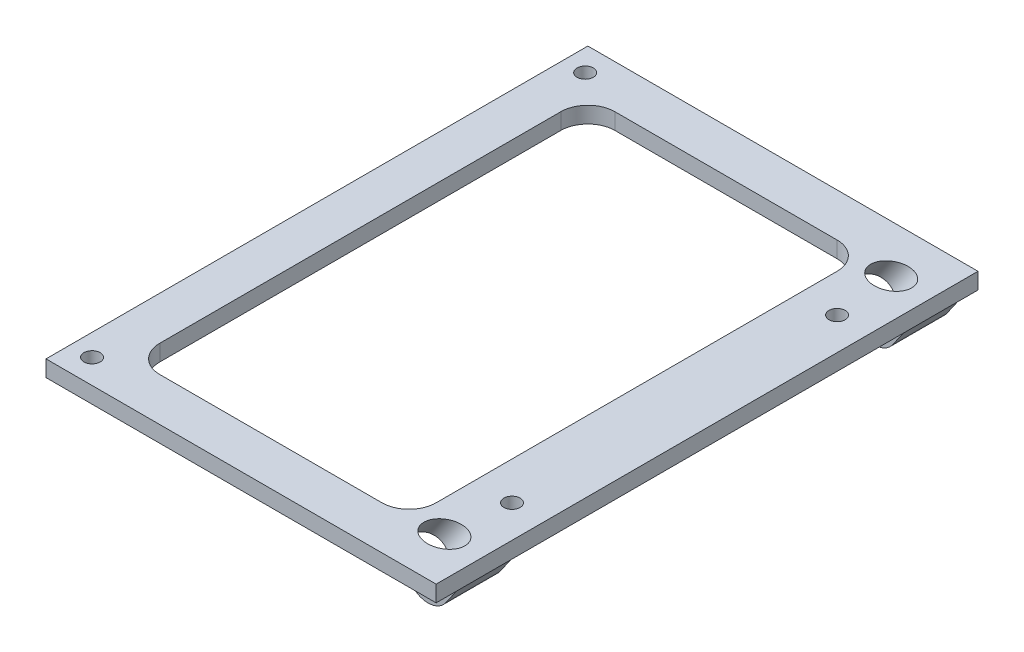
ISO-10303-21;
HEADER;
FILE_DESCRIPTION(('STEP AP214'),'2;1');
FILE_NAME('part.step','',(''),(''),'','','');
FILE_SCHEMA(('AUTOMOTIVE_DESIGN { 1 0 10303 214 1 1 1 1 }'));
ENDSEC;
DATA;
#1=APPLICATION_CONTEXT('core data for automotive mechanical design processes');
#2=APPLICATION_PROTOCOL_DEFINITION('international standard','automotive_design',2000,#1);
#3=PRODUCT_CONTEXT('',#1,'mechanical');
#4=PRODUCT('Part','Part','',(#3));
#5=PRODUCT_RELATED_PRODUCT_CATEGORY('part','',(#4));
#6=PRODUCT_DEFINITION_FORMATION('','',#4);
#7=PRODUCT_DEFINITION_CONTEXT('part definition',#1,'design');
#8=PRODUCT_DEFINITION('design','',#6,#7);
#9=PRODUCT_DEFINITION_SHAPE('','',#8);
#10=(LENGTH_UNIT() NAMED_UNIT(*) SI_UNIT(.MILLI.,.METRE.));
#11=(NAMED_UNIT(*) PLANE_ANGLE_UNIT() SI_UNIT($,.RADIAN.));
#12=(NAMED_UNIT(*) SI_UNIT($,.STERADIAN.) SOLID_ANGLE_UNIT());
#13=UNCERTAINTY_MEASURE_WITH_UNIT(LENGTH_MEASURE(1.E-05),#10,'distance_accuracy_value','');
#14=(GEOMETRIC_REPRESENTATION_CONTEXT(3) GLOBAL_UNCERTAINTY_ASSIGNED_CONTEXT((#13)) GLOBAL_UNIT_ASSIGNED_CONTEXT((#10,
#11,#12)) REPRESENTATION_CONTEXT('',''));
#15=CARTESIAN_POINT('',(0.,0.,0.));
#16=DIRECTION('',(0.,0.,1.));
#17=DIRECTION('',(1.,0.,0.));
#18=AXIS2_PLACEMENT_3D('',#15,#16,#17);
#19=CARTESIAN_POINT('',(62.,-3.,0.));
#20=DIRECTION('',(1.,0.,0.));
#21=DIRECTION('',(0.,0.,-1.));
#22=AXIS2_PLACEMENT_3D('',#19,#20,#21);
#23=PLANE('',#22);
#24=DIRECTION('',(0.,0.,1.));
#25=VECTOR('',#24,1.);
#26=CARTESIAN_POINT('',(62.,-3.,31.2272925792628));
#27=LINE('',#26,#25);
#28=CARTESIAN_POINT('',(62.,-3.,36.2272925792628));
#29=VERTEX_POINT('',#28);
#30=CARTESIAN_POINT('',(62.,-3.,37.));
#31=VERTEX_POINT('',#30);
#32=EDGE_CURVE('E367',#29,#31,#27,.T.);
#33=ORIENTED_EDGE('',*,*,#32,.T.);
#34=DIRECTION('',(0.,1.,0.));
#35=VECTOR('',#34,1.);
#36=CARTESIAN_POINT('',(62.,-3.,37.));
#37=LINE('',#36,#35);
#38=CARTESIAN_POINT('',(62.,0.,37.));
#39=VERTEX_POINT('',#38);
#40=EDGE_CURVE('E249',#31,#39,#37,.T.);
#41=ORIENTED_EDGE('',*,*,#40,.T.);
#42=DIRECTION('',(0.,0.,-1.));
#43=VECTOR('',#42,1.);
#44=CARTESIAN_POINT('',(62.,0.,0.));
#45=LINE('',#44,#43);
#46=CARTESIAN_POINT('',(62.,0.,-37.));
#47=VERTEX_POINT('',#46);
#48=EDGE_CURVE('E270',#39,#47,#45,.T.);
#49=ORIENTED_EDGE('',*,*,#48,.T.);
#50=DIRECTION('',(0.,1.,0.));
#51=VECTOR('',#50,1.);
#52=CARTESIAN_POINT('',(62.,-3.,-37.));
#53=LINE('',#52,#51);
#54=CARTESIAN_POINT('',(62.,-3.,-37.));
#55=VERTEX_POINT('',#54);
#56=EDGE_CURVE('E252',#55,#47,#53,.T.);
#57=ORIENTED_EDGE('',*,*,#56,.F.);
#58=DIRECTION('',(0.,0.,-1.));
#59=VECTOR('',#58,1.);
#60=CARTESIAN_POINT('',(62.,-3.,-31.2272925792628));
#61=LINE('',#60,#59);
#62=CARTESIAN_POINT('',(62.,-3.,-36.2272925792628));
#63=VERTEX_POINT('',#62);
#64=EDGE_CURVE('E339',#63,#55,#61,.T.);
#65=ORIENTED_EDGE('',*,*,#64,.F.);
#66=DIRECTION('',(0.,0.,-1.));
#67=VECTOR('',#66,1.);
#68=CARTESIAN_POINT('',(62.,-3.,0.));
#69=LINE('',#68,#67);
#70=EDGE_CURVE('E305',#29,#63,#69,.T.);
#71=ORIENTED_EDGE('',*,*,#70,.F.);
#72=EDGE_LOOP('',(#33,#41,#49,#57,#65,#71));
#73=FACE_BOUND('',#72,.T.);
#74=ADVANCED_FACE('F34',(#73),#23,.F.);
#75=CARTESIAN_POINT('',(62.,-14.,36.2272925792628));
#76=DIRECTION('',(0.,0.,-1.));
#77=DIRECTION('',(-1.,0.,0.));
#78=AXIS2_PLACEMENT_3D('',#75,#76,#77);
#79=PLANE('',#78);
#80=DIRECTION('',(0.573576436351039,0.819152044288997,0.));
#81=VECTOR('',#80,1.);
#82=CARTESIAN_POINT('',(65.5548215172945,-16.4891128233996,36.2272925792628));
#83=LINE('',#82,#81);
#84=CARTESIAN_POINT('',(73.0174366770211,-5.83139385795238,36.2272925792628));
#85=VERTEX_POINT('',#84);
#86=CARTESIAN_POINT('',(75.,-3.,36.2272925792628));
#87=VERTEX_POINT('',#86);
#88=EDGE_CURVE('E364',#85,#87,#83,.T.);
#89=ORIENTED_EDGE('',*,*,#88,.F.);
#90=CARTESIAN_POINT('',(69.7408284998651,-3.53708811254823,36.2272925792628));
#91=DIRECTION('',(0.,0.,-1.));
#92=DIRECTION('',(-1.,0.,0.));
#93=AXIS2_PLACEMENT_3D('',#90,#91,#92);
#94=CIRCLE('',#93,4.);
#95=CARTESIAN_POINT('',(67.446522754461,-6.81369628970421,36.2272925792628));
#96=VERTEX_POINT('',#95);
#97=EDGE_CURVE('E11',#85,#96,#94,.T.);
#98=ORIENTED_EDGE('',*,*,#97,.T.);
#99=DIRECTION('',(-0.819152044288996,0.573576436351039,0.));
#100=VECTOR('',#99,1.);
#101=CARTESIAN_POINT('',(67.1683094143225,-6.61888921170874,36.2272925792628));
#102=LINE('',#101,#100);
#103=EDGE_CURVE('E362',#96,#29,#102,.T.);
#104=ORIENTED_EDGE('',*,*,#103,.T.);
#105=DIRECTION('',(-1.,0.,0.));
#106=VECTOR('',#105,1.);
#107=CARTESIAN_POINT('',(62.,-3.,36.2272925792628));
#108=LINE('',#107,#106);
#109=EDGE_CURVE('E359',#87,#29,#108,.T.);
#110=ORIENTED_EDGE('',*,*,#109,.F.);
#111=EDGE_LOOP('',(#89,#98,#104,#110));
#112=FACE_BOUND('',#111,.T.);
#113=ADVANCED_FACE('F488',(#112),#79,.T.);
#114=CARTESIAN_POINT('',(62.,-14.,46.2272925792628));
#115=DIRECTION('',(0.,0.,1.));
#116=DIRECTION('',(1.,0.,0.));
#117=AXIS2_PLACEMENT_3D('',#114,#115,#116);
#118=PLANE('',#117);
#119=DIRECTION('',(0.819152044288996,-0.573576436351039,0.));
#120=VECTOR('',#119,1.);
#121=CARTESIAN_POINT('',(18.9878366257249,27.1174410293745,46.2272925792628));
#122=LINE('',#121,#120);
#123=CARTESIAN_POINT('',(62.,-3.,46.2272925792628));
#124=VERTEX_POINT('',#123);
#125=CARTESIAN_POINT('',(67.446522754461,-6.81369628970421,46.2272925792628));
#126=VERTEX_POINT('',#125);
#127=EDGE_CURVE('E212',#124,#126,#122,.T.);
#128=ORIENTED_EDGE('',*,*,#127,.T.);
#129=CARTESIAN_POINT('',(69.7408284998651,-3.53708811254823,46.2272925792628));
#130=DIRECTION('',(0.,0.,1.));
#131=DIRECTION('',(1.,0.,0.));
#132=AXIS2_PLACEMENT_3D('',#129,#130,#131);
#133=CIRCLE('',#132,4.);
#134=CARTESIAN_POINT('',(73.0174366770211,-5.83139385795238,46.2272925792628));
#135=VERTEX_POINT('',#134);
#136=EDGE_CURVE('E56',#126,#135,#133,.T.);
#137=ORIENTED_EDGE('',*,*,#136,.T.);
#138=DIRECTION('',(-0.573576436351039,-0.819152044288997,0.));
#139=VECTOR('',#138,1.);
#140=CARTESIAN_POINT('',(51.735294305892,-36.2254430644828,46.2272925792628));
#141=LINE('',#140,#139);
#142=CARTESIAN_POINT('',(75.,-3.,46.2272925792628));
#143=VERTEX_POINT('',#142);
#144=EDGE_CURVE('E369',#143,#135,#141,.T.);
#145=ORIENTED_EDGE('',*,*,#144,.F.);
#146=DIRECTION('',(1.,0.,0.));
#147=VECTOR('',#146,1.);
#148=CARTESIAN_POINT('',(62.,-3.,46.2272925792628));
#149=LINE('',#148,#147);
#150=EDGE_CURVE('E357',#124,#143,#149,.T.);
#151=ORIENTED_EDGE('',*,*,#150,.F.);
#152=EDGE_LOOP('',(#128,#137,#145,#151));
#153=FACE_BOUND('',#152,.T.);
#154=ADVANCED_FACE('F505',(#153),#118,.T.);
#155=CARTESIAN_POINT('',(0.,-3.,0.));
#156=DIRECTION('',(0.,-1.,0.));
#157=DIRECTION('',(0.,0.,-1.));
#158=AXIS2_PLACEMENT_3D('',#155,#156,#157);
#159=PLANE('',#158);
#160=CARTESIAN_POINT('',(69.,-3.,-30.));
#161=DIRECTION('',(0.,-1.,0.));
#162=DIRECTION('',(0.,0.,-1.));
#163=AXIS2_PLACEMENT_3D('',#160,#161,#162);
#164=CIRCLE('',#163,1.5);
#165=CARTESIAN_POINT('',(69.,-3.,-31.5));
#166=VERTEX_POINT('',#165);
#167=EDGE_CURVE('E198',#166,#166,#164,.T.);
#168=ORIENTED_EDGE('',*,*,#167,.F.);
#169=EDGE_LOOP('',(#168));
#170=FACE_BOUND('',#169,.T.);
#171=CARTESIAN_POINT('',(69.,-3.,30.));
#172=DIRECTION('',(0.,-1.,0.));
#173=DIRECTION('',(0.,0.,-1.));
#174=AXIS2_PLACEMENT_3D('',#171,#172,#173);
#175=CIRCLE('',#174,1.5);
#176=CARTESIAN_POINT('',(69.,-3.,28.5));
#177=VERTEX_POINT('',#176);
#178=EDGE_CURVE('E377',#177,#177,#175,.T.);
#179=ORIENTED_EDGE('',*,*,#178,.F.);
#180=EDGE_LOOP('',(#179));
#181=FACE_BOUND('',#180,.T.);
#182=ORIENTED_EDGE('',*,*,#109,.T.);
#183=ORIENTED_EDGE('',*,*,#70,.T.);
#184=DIRECTION('',(-1.,0.,0.));
#185=VECTOR('',#184,1.);
#186=CARTESIAN_POINT('',(62.,-3.,-36.2272925792628));
#187=LINE('',#186,#185);
#188=CARTESIAN_POINT('',(75.,-3.,-36.2272925792628));
#189=VERTEX_POINT('',#188);
#190=EDGE_CURVE('E299',#189,#63,#187,.T.);
#191=ORIENTED_EDGE('',*,*,#190,.F.);
#192=DIRECTION('',(0.,0.,-1.));
#193=VECTOR('',#192,1.);
#194=CARTESIAN_POINT('',(75.,-3.,0.));
#195=LINE('',#194,#193);
#196=EDGE_CURVE('E327',#87,#189,#195,.T.);
#197=ORIENTED_EDGE('',*,*,#196,.F.);
#198=EDGE_LOOP('',(#182,#183,#191,#197));
#199=FACE_BOUND('',#198,.T.);
#200=ADVANCED_FACE('F486',(#170,#181,#199),#159,.T.);
#201=CARTESIAN_POINT('',(75.,-3.,0.));
#202=DIRECTION('',(1.,0.,0.));
#203=DIRECTION('',(0.,0.,-1.));
#204=AXIS2_PLACEMENT_3D('',#201,#202,#203);
#205=PLANE('',#204);
#206=DIRECTION('',(0.,0.,1.));
#207=VECTOR('',#206,1.);
#208=CARTESIAN_POINT('',(75.,-3.,31.2272925792628));
#209=LINE('',#208,#207);
#210=EDGE_CURVE('E366',#87,#143,#209,.T.);
#211=ORIENTED_EDGE('',*,*,#210,.F.);
#212=ORIENTED_EDGE('',*,*,#196,.T.);
#213=DIRECTION('',(0.,0.,-1.));
#214=VECTOR('',#213,1.);
#215=CARTESIAN_POINT('',(75.,-3.,-31.2272925792628));
#216=LINE('',#215,#214);
#217=CARTESIAN_POINT('',(75.,-3.,-46.2272925792628));
#218=VERTEX_POINT('',#217);
#219=EDGE_CURVE('E342',#189,#218,#216,.T.);
#220=ORIENTED_EDGE('',*,*,#219,.T.);
#221=CARTESIAN_POINT('',(75.,-3.,-50.));
#222=VERTEX_POINT('',#221);
#223=EDGE_CURVE('E328',#218,#222,#195,.T.);
#224=ORIENTED_EDGE('',*,*,#223,.T.);
#225=DIRECTION('',(0.,1.,0.));
#226=VECTOR('',#225,1.);
#227=CARTESIAN_POINT('',(75.,-3.,-50.));
#228=LINE('',#227,#226);
#229=CARTESIAN_POINT('',(75.,0.,-50.));
#230=VERTEX_POINT('',#229);
#231=EDGE_CURVE('E232',#222,#230,#228,.T.);
#232=ORIENTED_EDGE('',*,*,#231,.T.);
#233=DIRECTION('',(0.,0.,-1.));
#234=VECTOR('',#233,1.);
#235=CARTESIAN_POINT('',(75.,0.,0.));
#236=LINE('',#235,#234);
#237=CARTESIAN_POINT('',(75.,0.,50.));
#238=VERTEX_POINT('',#237);
#239=EDGE_CURVE('E290',#238,#230,#236,.T.);
#240=ORIENTED_EDGE('',*,*,#239,.F.);
#241=DIRECTION('',(0.,1.,0.));
#242=VECTOR('',#241,1.);
#243=CARTESIAN_POINT('',(75.,-3.,50.));
#244=LINE('',#243,#242);
#245=CARTESIAN_POINT('',(75.,-3.,50.));
#246=VERTEX_POINT('',#245);
#247=EDGE_CURVE('E234',#246,#238,#244,.T.);
#248=ORIENTED_EDGE('',*,*,#247,.F.);
#249=EDGE_CURVE('E324',#246,#143,#195,.T.);
#250=ORIENTED_EDGE('',*,*,#249,.T.);
#251=EDGE_LOOP('',(#211,#212,#220,#224,#232,#240,#248,#250));
#252=FACE_BOUND('',#251,.T.);
#253=ADVANCED_FACE('F483',(#252),#205,.T.);
#254=CARTESIAN_POINT('',(11.,-3.,0.));
#255=DIRECTION('',(-1.,0.,0.));
#256=DIRECTION('',(0.,0.,1.));
#257=AXIS2_PLACEMENT_3D('',#254,#255,#256);
#258=PLANE('',#257);
#259=DIRECTION('',(0.,0.,1.));
#260=VECTOR('',#259,1.);
#261=CARTESIAN_POINT('',(11.,0.,0.));
#262=LINE('',#261,#260);
#263=CARTESIAN_POINT('',(11.,0.,-37.));
#264=VERTEX_POINT('',#263);
#265=CARTESIAN_POINT('',(11.,0.,37.));
#266=VERTEX_POINT('',#265);
#267=EDGE_CURVE('E278',#264,#266,#262,.T.);
#268=ORIENTED_EDGE('',*,*,#267,.T.);
#269=DIRECTION('',(0.,1.,0.));
#270=VECTOR('',#269,1.);
#271=CARTESIAN_POINT('',(11.,-3.,37.));
#272=LINE('',#271,#270);
#273=CARTESIAN_POINT('',(11.,-3.,37.));
#274=VERTEX_POINT('',#273);
#275=EDGE_CURVE('E239',#274,#266,#272,.T.);
#276=ORIENTED_EDGE('',*,*,#275,.F.);
#277=DIRECTION('',(0.,0.,1.));
#278=VECTOR('',#277,1.);
#279=CARTESIAN_POINT('',(11.,-3.,0.));
#280=LINE('',#279,#278);
#281=CARTESIAN_POINT('',(11.,-3.,-37.));
#282=VERTEX_POINT('',#281);
#283=EDGE_CURVE('E313',#282,#274,#280,.T.);
#284=ORIENTED_EDGE('',*,*,#283,.F.);
#285=DIRECTION('',(0.,1.,0.));
#286=VECTOR('',#285,1.);
#287=CARTESIAN_POINT('',(11.,-3.,-37.));
#288=LINE('',#287,#286);
#289=EDGE_CURVE('E231',#282,#264,#288,.T.);
#290=ORIENTED_EDGE('',*,*,#289,.T.);
#291=EDGE_LOOP('',(#268,#276,#284,#290));
#292=FACE_BOUND('',#291,.T.);
#293=ADVANCED_FACE('F413',(#292),#258,.F.);
#294=CARTESIAN_POINT('',(16.,-3.,37.));
#295=DIRECTION('',(0.,1.,0.));
#296=DIRECTION('',(0.,0.,1.));
#297=AXIS2_PLACEMENT_3D('',#294,#295,#296);
#298=CYLINDRICAL_SURFACE('',#297,5.00000000000001);
#299=CARTESIAN_POINT('',(16.,0.,37.));
#300=DIRECTION('',(0.,-1.,0.));
#301=DIRECTION('',(0.,0.,-1.));
#302=AXIS2_PLACEMENT_3D('',#299,#300,#301);
#303=CIRCLE('',#302,5.00000000000001);
#304=CARTESIAN_POINT('',(16.,0.,42.));
#305=VERTEX_POINT('',#304);
#306=EDGE_CURVE('E276',#266,#305,#303,.F.);
#307=ORIENTED_EDGE('',*,*,#306,.T.);
#308=DIRECTION('',(0.,1.,0.));
#309=VECTOR('',#308,1.);
#310=CARTESIAN_POINT('',(16.,-3.,42.));
#311=LINE('',#310,#309);
#312=CARTESIAN_POINT('',(16.,-3.,42.));
#313=VERTEX_POINT('',#312);
#314=EDGE_CURVE('E243',#313,#305,#311,.T.);
#315=ORIENTED_EDGE('',*,*,#314,.F.);
#316=CARTESIAN_POINT('',(16.,-3.,37.));
#317=DIRECTION('',(0.,-1.,0.));
#318=DIRECTION('',(0.,0.,-1.));
#319=AXIS2_PLACEMENT_3D('',#316,#317,#318);
#320=CIRCLE('',#319,5.00000000000001);
#321=EDGE_CURVE('E311',#274,#313,#320,.F.);
#322=ORIENTED_EDGE('',*,*,#321,.F.);
#323=ORIENTED_EDGE('',*,*,#275,.T.);
#324=EDGE_LOOP('',(#307,#315,#322,#323));
#325=FACE_BOUND('',#324,.T.);
#326=ADVANCED_FACE('F444',(#325),#298,.F.);
#327=CARTESIAN_POINT('',(0.,-3.,42.));
#328=DIRECTION('',(0.,0.,1.));
#329=DIRECTION('',(1.,0.,0.));
#330=AXIS2_PLACEMENT_3D('',#327,#328,#329);
#331=PLANE('',#330);
#332=DIRECTION('',(1.,0.,0.));
#333=VECTOR('',#332,1.);
#334=CARTESIAN_POINT('',(0.,0.,42.));
#335=LINE('',#334,#333);
#336=CARTESIAN_POINT('',(57.,0.,42.));
#337=VERTEX_POINT('',#336);
#338=EDGE_CURVE('E274',#305,#337,#335,.T.);
#339=ORIENTED_EDGE('',*,*,#338,.T.);
#340=DIRECTION('',(0.,1.,0.));
#341=VECTOR('',#340,1.);
#342=CARTESIAN_POINT('',(57.,-3.,42.));
#343=LINE('',#342,#341);
#344=CARTESIAN_POINT('',(57.,-3.,42.));
#345=VERTEX_POINT('',#344);
#346=EDGE_CURVE('E246',#345,#337,#343,.T.);
#347=ORIENTED_EDGE('',*,*,#346,.F.);
#348=DIRECTION('',(1.,0.,0.));
#349=VECTOR('',#348,1.);
#350=CARTESIAN_POINT('',(0.,-3.,42.));
#351=LINE('',#350,#349);
#352=EDGE_CURVE('E309',#313,#345,#351,.T.);
#353=ORIENTED_EDGE('',*,*,#352,.F.);
#354=ORIENTED_EDGE('',*,*,#314,.T.);
#355=EDGE_LOOP('',(#339,#347,#353,#354));
#356=FACE_BOUND('',#355,.T.);
#357=ADVANCED_FACE('F440',(#356),#331,.F.);
#358=CARTESIAN_POINT('',(57.,-3.,37.));
#359=DIRECTION('',(0.,1.,0.));
#360=DIRECTION('',(0.,0.,1.));
#361=AXIS2_PLACEMENT_3D('',#358,#359,#360);
#362=CYLINDRICAL_SURFACE('',#361,5.00000000000001);
#363=CARTESIAN_POINT('',(57.,0.,37.));
#364=DIRECTION('',(0.,-1.,0.));
#365=DIRECTION('',(0.,0.,-1.));
#366=AXIS2_PLACEMENT_3D('',#363,#364,#365);
#367=CIRCLE('',#366,5.00000000000001);
#368=EDGE_CURVE('E272',#337,#39,#367,.F.);
#369=ORIENTED_EDGE('',*,*,#368,.T.);
#370=ORIENTED_EDGE('',*,*,#40,.F.);
#371=CARTESIAN_POINT('',(57.,-3.,37.));
#372=DIRECTION('',(0.,-1.,0.));
#373=DIRECTION('',(0.,0.,-1.));
#374=AXIS2_PLACEMENT_3D('',#371,#372,#373);
#375=CIRCLE('',#374,5.00000000000001);
#376=EDGE_CURVE('E307',#345,#31,#375,.F.);
#377=ORIENTED_EDGE('',*,*,#376,.F.);
#378=ORIENTED_EDGE('',*,*,#346,.T.);
#379=EDGE_LOOP('',(#369,#370,#377,#378));
#380=FACE_BOUND('',#379,.T.);
#381=ADVANCED_FACE('F437',(#380),#362,.F.);
#382=CARTESIAN_POINT('',(57.,-3.,-37.));
#383=DIRECTION('',(0.,1.,0.));
#384=DIRECTION('',(0.,0.,1.));
#385=AXIS2_PLACEMENT_3D('',#382,#383,#384);
#386=CYLINDRICAL_SURFACE('',#385,5.00000000000001);
#387=CARTESIAN_POINT('',(57.,0.,-37.));
#388=DIRECTION('',(0.,-1.,0.));
#389=DIRECTION('',(0.,0.,-1.));
#390=AXIS2_PLACEMENT_3D('',#387,#388,#389);
#391=CIRCLE('',#390,5.00000000000001);
#392=CARTESIAN_POINT('',(57.,0.,-42.));
#393=VERTEX_POINT('',#392);
#394=EDGE_CURVE('E268',#47,#393,#391,.F.);
#395=ORIENTED_EDGE('',*,*,#394,.T.);
#396=DIRECTION('',(0.,1.,0.));
#397=VECTOR('',#396,1.);
#398=CARTESIAN_POINT('',(57.,-3.,-42.));
#399=LINE('',#398,#397);
#400=CARTESIAN_POINT('',(57.,-3.,-42.));
#401=VERTEX_POINT('',#400);
#402=EDGE_CURVE('E255',#401,#393,#399,.T.);
#403=ORIENTED_EDGE('',*,*,#402,.F.);
#404=CARTESIAN_POINT('',(57.,-3.,-37.));
#405=DIRECTION('',(0.,-1.,0.));
#406=DIRECTION('',(0.,0.,-1.));
#407=AXIS2_PLACEMENT_3D('',#404,#405,#406);
#408=CIRCLE('',#407,5.00000000000001);
#409=EDGE_CURVE('E303',#55,#401,#408,.F.);
#410=ORIENTED_EDGE('',*,*,#409,.F.);
#411=ORIENTED_EDGE('',*,*,#56,.T.);
#412=EDGE_LOOP('',(#395,#403,#410,#411));
#413=FACE_BOUND('',#412,.T.);
#414=ADVANCED_FACE('F428',(#413),#386,.F.);
#415=CARTESIAN_POINT('',(0.,-3.,-42.));
#416=DIRECTION('',(0.,0.,-1.));
#417=DIRECTION('',(-1.,0.,0.));
#418=AXIS2_PLACEMENT_3D('',#415,#416,#417);
#419=PLANE('',#418);
#420=DIRECTION('',(-1.,0.,0.));
#421=VECTOR('',#420,1.);
#422=CARTESIAN_POINT('',(0.,0.,-42.));
#423=LINE('',#422,#421);
#424=CARTESIAN_POINT('',(16.,0.,-42.));
#425=VERTEX_POINT('',#424);
#426=EDGE_CURVE('E266',#393,#425,#423,.T.);
#427=ORIENTED_EDGE('',*,*,#426,.T.);
#428=DIRECTION('',(0.,1.,0.));
#429=VECTOR('',#428,1.);
#430=CARTESIAN_POINT('',(16.,-3.,-42.));
#431=LINE('',#430,#429);
#432=CARTESIAN_POINT('',(16.,-3.,-42.));
#433=VERTEX_POINT('',#432);
#434=EDGE_CURVE('E258',#433,#425,#431,.T.);
#435=ORIENTED_EDGE('',*,*,#434,.F.);
#436=DIRECTION('',(-1.,0.,0.));
#437=VECTOR('',#436,1.);
#438=CARTESIAN_POINT('',(0.,-3.,-42.));
#439=LINE('',#438,#437);
#440=EDGE_CURVE('E301',#401,#433,#439,.T.);
#441=ORIENTED_EDGE('',*,*,#440,.F.);
#442=ORIENTED_EDGE('',*,*,#402,.T.);
#443=EDGE_LOOP('',(#427,#435,#441,#442));
#444=FACE_BOUND('',#443,.T.);
#445=ADVANCED_FACE('F422',(#444),#419,.F.);
#446=CARTESIAN_POINT('',(2.99999999999998,-3.,0.));
#447=DIRECTION('',(-1.,0.,0.));
#448=DIRECTION('',(0.,0.,1.));
#449=AXIS2_PLACEMENT_3D('',#446,#447,#448);
#450=PLANE('',#449);
#451=DIRECTION('',(0.,0.,1.));
#452=VECTOR('',#451,1.);
#453=CARTESIAN_POINT('',(2.99999999999998,0.,0.));
#454=LINE('',#453,#452);
#455=CARTESIAN_POINT('',(2.99999999999998,0.,-50.));
#456=VERTEX_POINT('',#455);
#457=CARTESIAN_POINT('',(2.99999999999998,0.,50.));
#458=VERTEX_POINT('',#457);
#459=EDGE_CURVE('E296',#456,#458,#454,.T.);
#460=ORIENTED_EDGE('',*,*,#459,.F.);
#461=DIRECTION('',(0.,1.,0.));
#462=VECTOR('',#461,1.);
#463=CARTESIAN_POINT('',(2.99999999999998,-3.,-50.));
#464=LINE('',#463,#462);
#465=CARTESIAN_POINT('',(2.99999999999998,-3.,-50.));
#466=VERTEX_POINT('',#465);
#467=EDGE_CURVE('E229',#466,#456,#464,.T.);
#468=ORIENTED_EDGE('',*,*,#467,.F.);
#469=DIRECTION('',(0.,0.,1.));
#470=VECTOR('',#469,1.);
#471=CARTESIAN_POINT('',(2.99999999999998,-3.,0.));
#472=LINE('',#471,#470);
#473=CARTESIAN_POINT('',(2.99999999999998,-3.,50.));
#474=VERTEX_POINT('',#473);
#475=EDGE_CURVE('E265',#466,#474,#472,.T.);
#476=ORIENTED_EDGE('',*,*,#475,.T.);
#477=DIRECTION('',(0.,1.,0.));
#478=VECTOR('',#477,1.);
#479=CARTESIAN_POINT('',(2.99999999999998,-3.,50.));
#480=LINE('',#479,#478);
#481=EDGE_CURVE('E236',#474,#458,#480,.T.);
#482=ORIENTED_EDGE('',*,*,#481,.T.);
#483=EDGE_LOOP('',(#460,#468,#476,#482));
#484=FACE_BOUND('',#483,.T.);
#485=ADVANCED_FACE('F535',(#484),#450,.T.);
#486=CARTESIAN_POINT('',(0.,-3.,-50.));
#487=DIRECTION('',(0.,0.,-1.));
#488=DIRECTION('',(-1.,0.,0.));
#489=AXIS2_PLACEMENT_3D('',#486,#487,#488);
#490=PLANE('',#489);
#491=DIRECTION('',(-1.,0.,0.));
#492=VECTOR('',#491,1.);
#493=CARTESIAN_POINT('',(0.,0.,-50.));
#494=LINE('',#493,#492);
#495=EDGE_CURVE('E293',#230,#456,#494,.T.);
#496=ORIENTED_EDGE('',*,*,#495,.F.);
#497=ORIENTED_EDGE('',*,*,#231,.F.);
#498=DIRECTION('',(-1.,0.,0.));
#499=VECTOR('',#498,1.);
#500=CARTESIAN_POINT('',(0.,-3.,-50.));
#501=LINE('',#500,#499);
#502=EDGE_CURVE('E329',#222,#466,#501,.T.);
#503=ORIENTED_EDGE('',*,*,#502,.T.);
#504=ORIENTED_EDGE('',*,*,#467,.T.);
#505=EDGE_LOOP('',(#496,#497,#503,#504));
#506=FACE_BOUND('',#505,.T.);
#507=ADVANCED_FACE('F522',(#506),#490,.T.);
#508=CARTESIAN_POINT('',(7.,-3.,45.5));
#509=DIRECTION('',(0.,1.,0.));
#510=DIRECTION('',(0.,0.,1.));
#511=AXIS2_PLACEMENT_3D('',#508,#509,#510);
#512=CYLINDRICAL_SURFACE('',#511,1.5);
#513=CARTESIAN_POINT('',(7.,-3.,45.5));
#514=DIRECTION('',(0.,-1.,0.));
#515=DIRECTION('',(0.,0.,-1.));
#516=AXIS2_PLACEMENT_3D('',#513,#514,#515);
#517=CIRCLE('',#516,1.5);
#518=CARTESIAN_POINT('',(7.,-3.,44.));
#519=VERTEX_POINT('',#518);
#520=EDGE_CURVE('E316',#519,#519,#517,.F.);
#521=ORIENTED_EDGE('',*,*,#520,.F.);
#522=EDGE_LOOP('',(#521));
#523=FACE_BOUND('',#522,.T.);
#524=CARTESIAN_POINT('',(7.,0.,45.5));
#525=DIRECTION('',(0.,-1.,0.));
#526=DIRECTION('',(0.,0.,-1.));
#527=AXIS2_PLACEMENT_3D('',#524,#525,#526);
#528=CIRCLE('',#527,1.5);
#529=CARTESIAN_POINT('',(7.,0.,44.));
#530=VERTEX_POINT('',#529);
#531=EDGE_CURVE('E281',#530,#530,#528,.F.);
#532=ORIENTED_EDGE('',*,*,#531,.T.);
#533=EDGE_LOOP('',(#532));
#534=FACE_BOUND('',#533,.T.);
#535=ADVANCED_FACE('F518',(#523,#534),#512,.F.);
#536=CARTESIAN_POINT('',(7.,-3.,-45.5));
#537=DIRECTION('',(0.,1.,0.));
#538=DIRECTION('',(0.,0.,1.));
#539=AXIS2_PLACEMENT_3D('',#536,#537,#538);
#540=CYLINDRICAL_SURFACE('',#539,1.5);
#541=CARTESIAN_POINT('',(7.,-3.,-45.5));
#542=DIRECTION('',(0.,-1.,0.));
#543=DIRECTION('',(0.,0.,-1.));
#544=AXIS2_PLACEMENT_3D('',#541,#542,#543);
#545=CIRCLE('',#544,1.5);
#546=CARTESIAN_POINT('',(7.,-3.,-47.));
#547=VERTEX_POINT('',#546);
#548=EDGE_CURVE('E319',#547,#547,#545,.F.);
#549=ORIENTED_EDGE('',*,*,#548,.F.);
#550=EDGE_LOOP('',(#549));
#551=FACE_BOUND('',#550,.T.);
#552=CARTESIAN_POINT('',(7.,0.,-45.5));
#553=DIRECTION('',(0.,-1.,0.));
#554=DIRECTION('',(0.,0.,-1.));
#555=AXIS2_PLACEMENT_3D('',#552,#553,#554);
#556=CIRCLE('',#555,1.5);
#557=CARTESIAN_POINT('',(7.,0.,-47.));
#558=VERTEX_POINT('',#557);
#559=EDGE_CURVE('E284',#558,#558,#556,.F.);
#560=ORIENTED_EDGE('',*,*,#559,.T.);
#561=EDGE_LOOP('',(#560));
#562=FACE_BOUND('',#561,.T.);
#563=ADVANCED_FACE('F521',(#551,#562),#540,.F.);
#564=CARTESIAN_POINT('',(0.,-3.,50.));
#565=DIRECTION('',(0.,0.,-1.));
#566=DIRECTION('',(-1.,0.,0.));
#567=AXIS2_PLACEMENT_3D('',#564,#565,#566);
#568=PLANE('',#567);
#569=DIRECTION('',(-1.,0.,0.));
#570=VECTOR('',#569,1.);
#571=CARTESIAN_POINT('',(0.,0.,50.));
#572=LINE('',#571,#570);
#573=EDGE_CURVE('E287',#238,#458,#572,.T.);
#574=ORIENTED_EDGE('',*,*,#573,.T.);
#575=ORIENTED_EDGE('',*,*,#481,.F.);
#576=DIRECTION('',(-1.,0.,0.));
#577=VECTOR('',#576,1.);
#578=CARTESIAN_POINT('',(0.,-3.,50.));
#579=LINE('',#578,#577);
#580=EDGE_CURVE('E322',#246,#474,#579,.T.);
#581=ORIENTED_EDGE('',*,*,#580,.F.);
#582=ORIENTED_EDGE('',*,*,#247,.T.);
#583=EDGE_LOOP('',(#574,#575,#581,#582));
#584=FACE_BOUND('',#583,.T.);
#585=ADVANCED_FACE('F526',(#584),#568,.F.);
#586=CARTESIAN_POINT('',(16.,-3.,-37.));
#587=DIRECTION('',(0.,1.,0.));
#588=DIRECTION('',(0.,0.,1.));
#589=AXIS2_PLACEMENT_3D('',#586,#587,#588);
#590=CYLINDRICAL_SURFACE('',#589,5.00000000000001);
#591=CARTESIAN_POINT('',(16.,0.,-37.));
#592=DIRECTION('',(0.,-1.,0.));
#593=DIRECTION('',(0.,0.,-1.));
#594=AXIS2_PLACEMENT_3D('',#591,#592,#593);
#595=CIRCLE('',#594,5.00000000000001);
#596=EDGE_CURVE('E263',#425,#264,#595,.F.);
#597=ORIENTED_EDGE('',*,*,#596,.T.);
#598=ORIENTED_EDGE('',*,*,#289,.F.);
#599=CARTESIAN_POINT('',(16.,-3.,-37.));
#600=DIRECTION('',(0.,-1.,0.));
#601=DIRECTION('',(0.,0.,-1.));
#602=AXIS2_PLACEMENT_3D('',#599,#600,#601);
#603=CIRCLE('',#602,5.00000000000001);
#604=EDGE_CURVE('E238',#433,#282,#603,.F.);
#605=ORIENTED_EDGE('',*,*,#604,.F.);
#606=ORIENTED_EDGE('',*,*,#434,.T.);
#607=EDGE_LOOP('',(#597,#598,#605,#606));
#608=FACE_BOUND('',#607,.T.);
#609=ADVANCED_FACE('F418',(#608),#590,.F.);
#610=DIRECTION('',(0.,0.,-1.));
#611=VECTOR('',#610,1.);
#612=CARTESIAN_POINT('',(62.,-3.,0.));
#613=LINE('',#612,#611);
#614=CARTESIAN_POINT('',(62.,-3.,42.026890473066));
#615=VERTEX_POINT('',#614);
#616=EDGE_CURVE('E191',#124,#615,#613,.T.);
#617=ORIENTED_EDGE('',*,*,#616,.F.);
#618=ORIENTED_EDGE('',*,*,#150,.T.);
#619=ORIENTED_EDGE('',*,*,#249,.F.);
#620=ORIENTED_EDGE('',*,*,#580,.T.);
#621=ORIENTED_EDGE('',*,*,#475,.F.);
#622=ORIENTED_EDGE('',*,*,#502,.F.);
#623=ORIENTED_EDGE('',*,*,#223,.F.);
#624=DIRECTION('',(1.,0.,0.));
#625=VECTOR('',#624,1.);
#626=CARTESIAN_POINT('',(62.,-3.,-46.2272925792628));
#627=LINE('',#626,#625);
#628=CARTESIAN_POINT('',(62.,-3.,-46.2272925792628));
#629=VERTEX_POINT('',#628);
#630=EDGE_CURVE('E336',#629,#218,#627,.T.);
#631=ORIENTED_EDGE('',*,*,#630,.F.);
#632=DIRECTION('',(0.,0.,-1.));
#633=VECTOR('',#632,1.);
#634=CARTESIAN_POINT('',(62.,-3.,-36.2272925792628));
#635=LINE('',#634,#633);
#636=CARTESIAN_POINT('',(62.,-3.,-42.026890473066));
#637=VERTEX_POINT('',#636);
#638=EDGE_CURVE('E242',#637,#629,#635,.T.);
#639=ORIENTED_EDGE('',*,*,#638,.F.);
#640=CARTESIAN_POINT('',(62.,-3.,-40.4276946854597));
#641=VERTEX_POINT('',#640);
#642=EDGE_CURVE('E341',#641,#637,#635,.T.);
#643=ORIENTED_EDGE('',*,*,#642,.F.);
#644=EDGE_CURVE('E228',#55,#641,#635,.T.);
#645=ORIENTED_EDGE('',*,*,#644,.F.);
#646=ORIENTED_EDGE('',*,*,#409,.T.);
#647=ORIENTED_EDGE('',*,*,#440,.T.);
#648=ORIENTED_EDGE('',*,*,#604,.T.);
#649=ORIENTED_EDGE('',*,*,#283,.T.);
#650=ORIENTED_EDGE('',*,*,#321,.T.);
#651=ORIENTED_EDGE('',*,*,#352,.T.);
#652=ORIENTED_EDGE('',*,*,#376,.T.);
#653=CARTESIAN_POINT('',(62.,-3.,40.4276946854597));
#654=VERTEX_POINT('',#653);
#655=EDGE_CURVE('E207',#654,#31,#613,.T.);
#656=ORIENTED_EDGE('',*,*,#655,.F.);
#657=EDGE_CURVE('E196',#615,#654,#613,.T.);
#658=ORIENTED_EDGE('',*,*,#657,.F.);
#659=EDGE_LOOP('',(#617,#618,#619,#620,#621,#622,#623,#631,#639,#643,#645,#646,#647,#648,#649,
#650,#651,#652,#656,#658));
#660=FACE_BOUND('',#659,.T.);
#661=ORIENTED_EDGE('',*,*,#548,.T.);
#662=EDGE_LOOP('',(#661));
#663=FACE_BOUND('',#662,.T.);
#664=ORIENTED_EDGE('',*,*,#520,.T.);
#665=EDGE_LOOP('',(#664));
#666=FACE_BOUND('',#665,.T.);
#667=ADVANCED_FACE('F202',(#660,#663,#666),#159,.T.);
#668=CARTESIAN_POINT('',(0.,0.,0.));
#669=DIRECTION('',(0.,-1.,0.));
#670=DIRECTION('',(0.,0.,-1.));
#671=AXIS2_PLACEMENT_3D('',#668,#669,#670);
#672=PLANE('',#671);
#673=CARTESIAN_POINT('',(69.,0.,-30.));
#674=DIRECTION('',(0.,1.,0.));
#675=DIRECTION('',(0.,0.,1.));
#676=AXIS2_PLACEMENT_3D('',#673,#674,#675);
#677=CIRCLE('',#676,1.5);
#678=CARTESIAN_POINT('',(69.,0.,-28.5));
#679=VERTEX_POINT('',#678);
#680=EDGE_CURVE('E380',#679,#679,#677,.T.);
#681=ORIENTED_EDGE('',*,*,#680,.F.);
#682=EDGE_LOOP('',(#681));
#683=FACE_BOUND('',#682,.T.);
#684=CARTESIAN_POINT('',(69.,0.,30.));
#685=DIRECTION('',(0.,1.,0.));
#686=DIRECTION('',(0.,0.,1.));
#687=AXIS2_PLACEMENT_3D('',#684,#685,#686);
#688=CIRCLE('',#687,1.5);
#689=CARTESIAN_POINT('',(69.,0.,31.5));
#690=VERTEX_POINT('',#689);
#691=EDGE_CURVE('E381',#690,#690,#688,.T.);
#692=ORIENTED_EDGE('',*,*,#691,.F.);
#693=EDGE_LOOP('',(#692));
#694=FACE_BOUND('',#693,.T.);
#695=CARTESIAN_POINT('',(67.7569684979345,0.,41.2272925792628));
#696=DIRECTION('',(0.,-1.,0.));
#697=DIRECTION('',(-1.,0.,0.));
#698=AXIS2_PLACEMENT_3D('',#695,#696,#697);
#699=ELLIPSE('',#698,3.78440122516049,3.1);
#700=CARTESIAN_POINT('',(63.972567272774,0.,41.2272925792628));
#701=VERTEX_POINT('',#700);
#702=EDGE_CURVE('E197',#701,#701,#699,.F.);
#703=ORIENTED_EDGE('',*,*,#702,.F.);
#704=EDGE_LOOP('',(#703));
#705=FACE_BOUND('',#704,.T.);
#706=CARTESIAN_POINT('',(67.7569684979345,0.,-41.2272925792628));
#707=DIRECTION('',(0.,-1.,0.));
#708=DIRECTION('',(-1.,0.,0.));
#709=AXIS2_PLACEMENT_3D('',#706,#707,#708);
#710=ELLIPSE('',#709,3.78440122516049,3.1);
#711=CARTESIAN_POINT('',(63.972567272774,0.,-41.2272925792628));
#712=VERTEX_POINT('',#711);
#713=EDGE_CURVE('E352',#712,#712,#710,.T.);
#714=ORIENTED_EDGE('',*,*,#713,.T.);
#715=EDGE_LOOP('',(#714));
#716=FACE_BOUND('',#715,.T.);
#717=ORIENTED_EDGE('',*,*,#459,.T.);
#718=ORIENTED_EDGE('',*,*,#573,.F.);
#719=ORIENTED_EDGE('',*,*,#239,.T.);
#720=ORIENTED_EDGE('',*,*,#495,.T.);
#721=EDGE_LOOP('',(#717,#718,#719,#720));
#722=FACE_BOUND('',#721,.T.);
#723=ORIENTED_EDGE('',*,*,#559,.F.);
#724=EDGE_LOOP('',(#723));
#725=FACE_BOUND('',#724,.T.);
#726=ORIENTED_EDGE('',*,*,#531,.F.);
#727=EDGE_LOOP('',(#726));
#728=FACE_BOUND('',#727,.T.);
#729=ORIENTED_EDGE('',*,*,#267,.F.);
#730=ORIENTED_EDGE('',*,*,#596,.F.);
#731=ORIENTED_EDGE('',*,*,#426,.F.);
#732=ORIENTED_EDGE('',*,*,#394,.F.);
#733=ORIENTED_EDGE('',*,*,#48,.F.);
#734=ORIENTED_EDGE('',*,*,#368,.F.);
#735=ORIENTED_EDGE('',*,*,#338,.F.);
#736=ORIENTED_EDGE('',*,*,#306,.F.);
#737=EDGE_LOOP('',(#729,#730,#731,#732,#733,#734,#735,#736));
#738=FACE_BOUND('',#737,.T.);
#739=ADVANCED_FACE('F389',(#683,#694,#705,#716,#722,#725,#728,#738),#672,.F.);
#740=CARTESIAN_POINT('',(62.,-14.,-46.2272925792628));
#741=DIRECTION('',(0.,0.,1.));
#742=DIRECTION('',(1.,0.,0.));
#743=AXIS2_PLACEMENT_3D('',#740,#741,#742);
#744=PLANE('',#743);
#745=DIRECTION('',(-0.573576436351039,-0.819152044288997,0.));
#746=VECTOR('',#745,1.);
#747=CARTESIAN_POINT('',(51.735294305892,-36.2254430644828,-46.2272925792628));
#748=LINE('',#747,#746);
#749=CARTESIAN_POINT('',(73.0174366770211,-5.83139385795238,-46.2272925792628));
#750=VERTEX_POINT('',#749);
#751=EDGE_CURVE('E345',#218,#750,#748,.T.);
#752=ORIENTED_EDGE('',*,*,#751,.T.);
#753=CARTESIAN_POINT('',(69.7408284998651,-3.53708811254822,-46.2272925792628));
#754=DIRECTION('',(0.,0.,1.));
#755=DIRECTION('',(1.,0.,0.));
#756=AXIS2_PLACEMENT_3D('',#753,#754,#755);
#757=CIRCLE('',#756,4.);
#758=CARTESIAN_POINT('',(67.446522754461,-6.81369628970421,-46.2272925792628));
#759=VERTEX_POINT('',#758);
#760=EDGE_CURVE('E465',#750,#759,#757,.F.);
#761=ORIENTED_EDGE('',*,*,#760,.T.);
#762=DIRECTION('',(0.819152044288996,-0.573576436351039,0.));
#763=VECTOR('',#762,1.);
#764=CARTESIAN_POINT('',(18.9878366257249,27.1174410293745,-46.2272925792628));
#765=LINE('',#764,#763);
#766=EDGE_CURVE('E349',#629,#759,#765,.T.);
#767=ORIENTED_EDGE('',*,*,#766,.F.);
#768=ORIENTED_EDGE('',*,*,#630,.T.);
#769=EDGE_LOOP('',(#752,#761,#767,#768));
#770=FACE_BOUND('',#769,.T.);
#771=ADVANCED_FACE('F392',(#770),#744,.F.);
#772=CARTESIAN_POINT('',(62.,-14.,-36.2272925792628));
#773=DIRECTION('',(0.,0.,-1.));
#774=DIRECTION('',(-1.,0.,0.));
#775=AXIS2_PLACEMENT_3D('',#772,#773,#774);
#776=PLANE('',#775);
#777=DIRECTION('',(0.819152044288996,-0.573576436351039,0.));
#778=VECTOR('',#777,1.);
#779=CARTESIAN_POINT('',(67.1683094143225,-6.61888921170874,-36.2272925792628));
#780=LINE('',#779,#778);
#781=CARTESIAN_POINT('',(67.446522754461,-6.81369628970421,-36.2272925792628));
#782=VERTEX_POINT('',#781);
#783=EDGE_CURVE('E218',#63,#782,#780,.T.);
#784=ORIENTED_EDGE('',*,*,#783,.T.);
#785=CARTESIAN_POINT('',(69.7408284998651,-3.53708811254822,-36.2272925792628));
#786=DIRECTION('',(0.,0.,-1.));
#787=DIRECTION('',(-1.,0.,0.));
#788=AXIS2_PLACEMENT_3D('',#785,#786,#787);
#789=CIRCLE('',#788,4.);
#790=CARTESIAN_POINT('',(73.0174366770211,-5.83139385795238,-36.2272925792628));
#791=VERTEX_POINT('',#790);
#792=EDGE_CURVE('E456',#782,#791,#789,.F.);
#793=ORIENTED_EDGE('',*,*,#792,.T.);
#794=DIRECTION('',(-0.573576436351039,-0.819152044288997,0.));
#795=VECTOR('',#794,1.);
#796=CARTESIAN_POINT('',(65.5548215172945,-16.4891128233996,-36.2272925792628));
#797=LINE('',#796,#795);
#798=EDGE_CURVE('E223',#189,#791,#797,.T.);
#799=ORIENTED_EDGE('',*,*,#798,.F.);
#800=ORIENTED_EDGE('',*,*,#190,.T.);
#801=EDGE_LOOP('',(#784,#793,#799,#800));
#802=FACE_BOUND('',#801,.T.);
#803=ADVANCED_FACE('F454',(#802),#776,.F.);
#804=CARTESIAN_POINT('',(18.9878366257249,27.1174410293745,-31.2272925792628));
#805=DIRECTION('',(0.573576436351039,0.819152044288996,0.));
#806=DIRECTION('',(-0.819152044288996,0.573576436351039,0.));
#807=AXIS2_PLACEMENT_3D('',#804,#805,#806);
#808=PLANE('',#807);
#809=ORIENTED_EDGE('',*,*,#766,.T.);
#810=DIRECTION('',(0.,0.,-1.));
#811=VECTOR('',#810,1.);
#812=CARTESIAN_POINT('',(67.446522754461,-6.81369628970421,-36.2272925792628));
#813=LINE('',#812,#811);
#814=EDGE_CURVE('E451',#759,#782,#813,.F.);
#815=ORIENTED_EDGE('',*,*,#814,.T.);
#816=ORIENTED_EDGE('',*,*,#783,.F.);
#817=ORIENTED_EDGE('',*,*,#64,.T.);
#818=ORIENTED_EDGE('',*,*,#644,.T.);
#819=CARTESIAN_POINT('',(64.4534449131809,-4.7179206227915,-41.2272925792628));
#820=DIRECTION('',(0.573576436351039,0.819152044288996,0.));
#821=DIRECTION('',(-0.819152044288996,0.573576436351039,0.));
#822=AXIS2_PLACEMENT_3D('',#819,#820,#821);
#823=CIRCLE('',#822,3.1);
#824=EDGE_CURVE('E214',#641,#637,#823,.T.);
#825=ORIENTED_EDGE('',*,*,#824,.T.);
#826=ORIENTED_EDGE('',*,*,#638,.T.);
#827=EDGE_LOOP('',(#809,#815,#816,#817,#818,#825,#826));
#828=FACE_BOUND('',#827,.T.);
#829=ADVANCED_FACE('F448',(#828),#808,.F.);
#830=CARTESIAN_POINT('',(51.735294305892,-36.2254430644828,-31.2272925792628));
#831=DIRECTION('',(0.819152044288996,-0.573576436351039,0.));
#832=DIRECTION('',(0.573576436351039,0.819152044288997,0.));
#833=AXIS2_PLACEMENT_3D('',#830,#831,#832);
#834=PLANE('',#833);
#835=ORIENTED_EDGE('',*,*,#798,.T.);
#836=DIRECTION('',(0.,0.,-1.));
#837=VECTOR('',#836,1.);
#838=CARTESIAN_POINT('',(73.0174366770211,-5.83139385795238,-46.2272925792628));
#839=LINE('',#838,#837);
#840=EDGE_CURVE('E190',#791,#750,#839,.T.);
#841=ORIENTED_EDGE('',*,*,#840,.T.);
#842=ORIENTED_EDGE('',*,*,#751,.F.);
#843=ORIENTED_EDGE('',*,*,#219,.F.);
#844=EDGE_LOOP('',(#835,#841,#842,#843));
#845=FACE_BOUND('',#844,.T.);
#846=ADVANCED_FACE('F471',(#845),#834,.T.);
#847=CARTESIAN_POINT('',(70.1398529127428,3.4031116273054,-41.2272925792628));
#848=DIRECTION('',(-0.573576436351039,-0.819152044288997,0.));
#849=DIRECTION('',(0.819152044288997,-0.573576436351039,0.));
#850=AXIS2_PLACEMENT_3D('',#847,#848,#849);
#851=CYLINDRICAL_SURFACE('',#850,3.1);
#852=CARTESIAN_POINT('',(64.4534449131809,-4.7179206227915,-41.2272925792628));
#853=DIRECTION('',(-0.573576436351039,-0.819152044288996,0.));
#854=DIRECTION('',(0.819152044288996,-0.573576436351039,0.));
#855=AXIS2_PLACEMENT_3D('',#852,#853,#854);
#856=CIRCLE('',#855,3.1);
#857=EDGE_CURVE('E355',#641,#637,#856,.T.);
#858=ORIENTED_EDGE('',*,*,#857,.T.);
#859=ORIENTED_EDGE('',*,*,#824,.F.);
#860=EDGE_LOOP('',(#858,#859));
#861=FACE_BOUND('',#860,.T.);
#862=ORIENTED_EDGE('',*,*,#713,.F.);
#863=EDGE_LOOP('',(#862));
#864=FACE_BOUND('',#863,.T.);
#865=ADVANCED_FACE('F563',(#861,#864),#851,.F.);
#866=CARTESIAN_POINT('',(64.4534449131809,-4.7179206227915,-41.2272925792628));
#867=DIRECTION('',(-0.573576436351039,-0.819152044288996,0.));
#868=DIRECTION('',(0.819152044288996,-0.573576436351039,0.));
#869=AXIS2_PLACEMENT_3D('',#866,#867,#868);
#870=PLANE('',#869);
#871=ORIENTED_EDGE('',*,*,#642,.T.);
#872=ORIENTED_EDGE('',*,*,#857,.F.);
#873=EDGE_LOOP('',(#871,#872));
#874=FACE_BOUND('',#873,.T.);
#875=ADVANCED_FACE('F555',(#874),#870,.F.);
#876=CARTESIAN_POINT('',(18.9878366257249,27.1174410293745,31.2272925792628));
#877=DIRECTION('',(-0.573576436351039,-0.819152044288996,0.));
#878=DIRECTION('',(0.819152044288996,-0.573576436351039,0.));
#879=AXIS2_PLACEMENT_3D('',#876,#877,#878);
#880=PLANE('',#879);
#881=ORIENTED_EDGE('',*,*,#103,.F.);
#882=DIRECTION('',(0.,0.,1.));
#883=VECTOR('',#882,1.);
#884=CARTESIAN_POINT('',(67.446522754461,-6.81369628970421,46.2272925792628));
#885=LINE('',#884,#883);
#886=EDGE_CURVE('E462',#96,#126,#885,.T.);
#887=ORIENTED_EDGE('',*,*,#886,.T.);
#888=ORIENTED_EDGE('',*,*,#127,.F.);
#889=ORIENTED_EDGE('',*,*,#616,.T.);
#890=CARTESIAN_POINT('',(64.4534449131809,-4.7179206227915,41.2272925792628));
#891=DIRECTION('',(-0.573576436351039,-0.819152044288996,0.));
#892=DIRECTION('',(0.819152044288996,-0.573576436351039,0.));
#893=AXIS2_PLACEMENT_3D('',#890,#891,#892);
#894=CIRCLE('',#893,3.1);
#895=EDGE_CURVE('E181',#615,#654,#894,.F.);
#896=ORIENTED_EDGE('',*,*,#895,.T.);
#897=ORIENTED_EDGE('',*,*,#655,.T.);
#898=ORIENTED_EDGE('',*,*,#32,.F.);
#899=EDGE_LOOP('',(#881,#887,#888,#889,#896,#897,#898));
#900=FACE_BOUND('',#899,.T.);
#901=ADVANCED_FACE('F210',(#900),#880,.T.);
#902=CARTESIAN_POINT('',(51.735294305892,-36.2254430644828,31.2272925792628));
#903=DIRECTION('',(-0.819152044288996,0.573576436351039,0.));
#904=DIRECTION('',(-0.573576436351039,-0.819152044288997,0.));
#905=AXIS2_PLACEMENT_3D('',#902,#903,#904);
#906=PLANE('',#905);
#907=ORIENTED_EDGE('',*,*,#144,.T.);
#908=DIRECTION('',(0.,0.,1.));
#909=VECTOR('',#908,1.);
#910=CARTESIAN_POINT('',(73.0174366770211,-5.83139385795238,36.2272925792628));
#911=LINE('',#910,#909);
#912=EDGE_CURVE('E42',#135,#85,#911,.F.);
#913=ORIENTED_EDGE('',*,*,#912,.T.);
#914=ORIENTED_EDGE('',*,*,#88,.T.);
#915=ORIENTED_EDGE('',*,*,#210,.T.);
#916=EDGE_LOOP('',(#907,#913,#914,#915));
#917=FACE_BOUND('',#916,.T.);
#918=ADVANCED_FACE('F547',(#917),#906,.F.);
#919=CARTESIAN_POINT('',(70.1398529127428,3.4031116273054,41.2272925792628));
#920=DIRECTION('',(-0.573576436351039,-0.819152044288997,0.));
#921=DIRECTION('',(0.819152044288997,-0.573576436351039,0.));
#922=AXIS2_PLACEMENT_3D('',#919,#920,#921);
#923=CYLINDRICAL_SURFACE('',#922,3.1);
#924=CARTESIAN_POINT('',(64.4534449131809,-4.7179206227915,41.2272925792628));
#925=DIRECTION('',(0.573576436351039,0.819152044288996,0.));
#926=DIRECTION('',(0.819152044288996,-0.573576436351039,0.));
#927=AXIS2_PLACEMENT_3D('',#924,#925,#926);
#928=CIRCLE('',#927,3.1);
#929=EDGE_CURVE('E185',#654,#615,#928,.T.);
#930=ORIENTED_EDGE('',*,*,#929,.F.);
#931=ORIENTED_EDGE('',*,*,#895,.F.);
#932=EDGE_LOOP('',(#930,#931));
#933=FACE_BOUND('',#932,.T.);
#934=ORIENTED_EDGE('',*,*,#702,.T.);
#935=EDGE_LOOP('',(#934));
#936=FACE_BOUND('',#935,.T.);
#937=ADVANCED_FACE('F183',(#933,#936),#923,.F.);
#938=CARTESIAN_POINT('',(64.4534449131809,-4.7179206227915,41.2272925792628));
#939=DIRECTION('',(-0.573576436351039,-0.819152044288996,0.));
#940=DIRECTION('',(0.819152044288996,-0.573576436351039,0.));
#941=AXIS2_PLACEMENT_3D('',#938,#939,#940);
#942=PLANE('',#941);
#943=ORIENTED_EDGE('',*,*,#657,.T.);
#944=ORIENTED_EDGE('',*,*,#929,.T.);
#945=EDGE_LOOP('',(#943,#944));
#946=FACE_BOUND('',#945,.T.);
#947=ADVANCED_FACE('F195',(#946),#942,.F.);
#948=CARTESIAN_POINT('',(69.7408284998651,-3.53708811254822,-31.2272925792628));
#949=DIRECTION('',(0.,0.,1.));
#950=DIRECTION('',(1.,0.,0.));
#951=AXIS2_PLACEMENT_3D('',#948,#949,#950);
#952=CYLINDRICAL_SURFACE('',#951,4.);
#953=ORIENTED_EDGE('',*,*,#792,.F.);
#954=ORIENTED_EDGE('',*,*,#814,.F.);
#955=ORIENTED_EDGE('',*,*,#760,.F.);
#956=ORIENTED_EDGE('',*,*,#840,.F.);
#957=EDGE_LOOP('',(#953,#954,#955,#956));
#958=FACE_BOUND('',#957,.T.);
#959=ADVANCED_FACE('F460',(#958),#952,.T.);
#960=CARTESIAN_POINT('',(69.7408284998651,-3.53708811254823,31.2272925792628));
#961=DIRECTION('',(0.,0.,-1.));
#962=DIRECTION('',(-1.,0.,0.));
#963=AXIS2_PLACEMENT_3D('',#960,#961,#962);
#964=CYLINDRICAL_SURFACE('',#963,4.);
#965=ORIENTED_EDGE('',*,*,#97,.F.);
#966=ORIENTED_EDGE('',*,*,#912,.F.);
#967=ORIENTED_EDGE('',*,*,#136,.F.);
#968=ORIENTED_EDGE('',*,*,#886,.F.);
#969=EDGE_LOOP('',(#965,#966,#967,#968));
#970=FACE_BOUND('',#969,.T.);
#971=ADVANCED_FACE('F36',(#970),#964,.T.);
#972=CARTESIAN_POINT('',(69.,-7.53708811254823,30.));
#973=DIRECTION('',(0.,1.,0.));
#974=DIRECTION('',(0.,0.,1.));
#975=AXIS2_PLACEMENT_3D('',#972,#973,#974);
#976=CYLINDRICAL_SURFACE('',#975,1.5);
#977=ORIENTED_EDGE('',*,*,#178,.T.);
#978=EDGE_LOOP('',(#977));
#979=FACE_BOUND('',#978,.T.);
#980=ORIENTED_EDGE('',*,*,#691,.T.);
#981=EDGE_LOOP('',(#980));
#982=FACE_BOUND('',#981,.T.);
#983=ADVANCED_FACE('F493',(#979,#982),#976,.F.);
#984=CARTESIAN_POINT('',(69.,-7.53708811254823,-30.));
#985=DIRECTION('',(0.,1.,0.));
#986=DIRECTION('',(0.,0.,1.));
#987=AXIS2_PLACEMENT_3D('',#984,#985,#986);
#988=CYLINDRICAL_SURFACE('',#987,1.5);
#989=ORIENTED_EDGE('',*,*,#167,.T.);
#990=EDGE_LOOP('',(#989));
#991=FACE_BOUND('',#990,.T.);
#992=ORIENTED_EDGE('',*,*,#680,.T.);
#993=EDGE_LOOP('',(#992));
#994=FACE_BOUND('',#993,.T.);
#995=ADVANCED_FACE('F387',(#991,#994),#988,.F.);
#996=CLOSED_SHELL('',(#74,#113,#154,#200,#253,#293,#326,#357,#381,#414,#445,#485,#507,#535,#563,
#585,#609,#667,#739,#771,#803,#829,#846,#865,#875,#901,#918,#937,#947,#959,#971,#983,#995));
#997=MANIFOLD_SOLID_BREP('B2',#996);
#998=ADVANCED_BREP_SHAPE_REPRESENTATION('',(#18,#997),#14);
#999=SHAPE_DEFINITION_REPRESENTATION(#9,#998);
ENDSEC;
END-ISO-10303-21;
